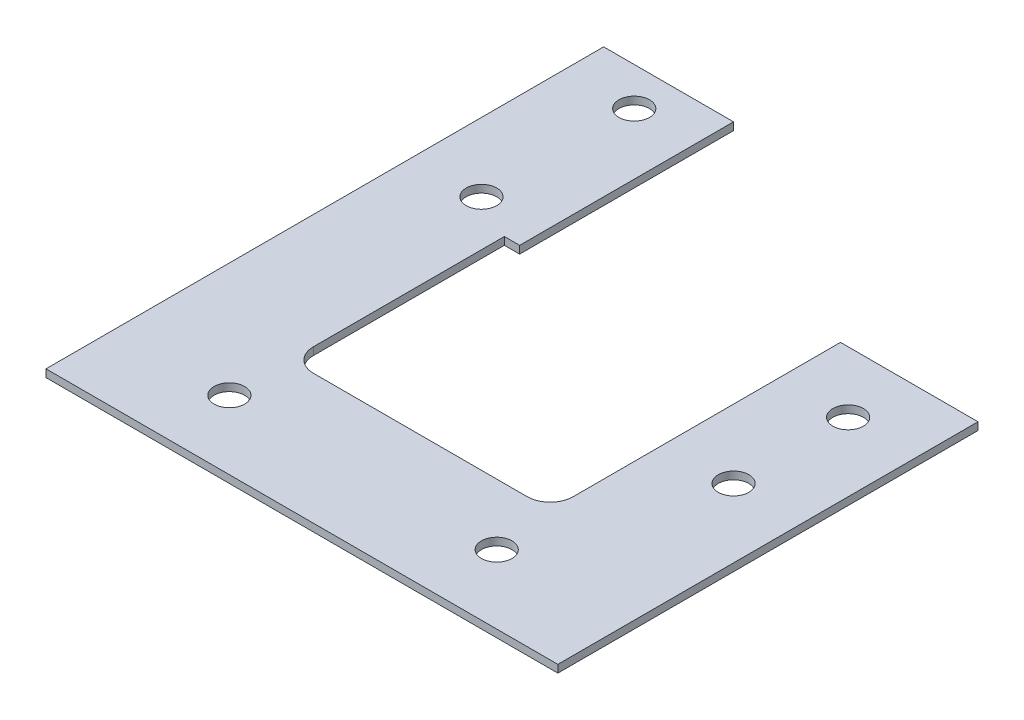
ISO-10303-21;
HEADER;
FILE_DESCRIPTION(('STEP AP214'),'2;1');
FILE_NAME('part.step','',(''),(''),'','','');
FILE_SCHEMA(('AUTOMOTIVE_DESIGN { 1 0 10303 214 1 1 1 1 }'));
ENDSEC;
DATA;
#1=APPLICATION_CONTEXT('core data for automotive mechanical design processes');
#2=APPLICATION_PROTOCOL_DEFINITION('international standard','automotive_design',2000,#1);
#3=PRODUCT_CONTEXT('',#1,'mechanical');
#4=PRODUCT('Part','Part','',(#3));
#5=PRODUCT_RELATED_PRODUCT_CATEGORY('part','',(#4));
#6=PRODUCT_DEFINITION_FORMATION('','',#4);
#7=PRODUCT_DEFINITION_CONTEXT('part definition',#1,'design');
#8=PRODUCT_DEFINITION('design','',#6,#7);
#9=PRODUCT_DEFINITION_SHAPE('','',#8);
#10=(LENGTH_UNIT() NAMED_UNIT(*) SI_UNIT(.MILLI.,.METRE.));
#11=(NAMED_UNIT(*) PLANE_ANGLE_UNIT() SI_UNIT($,.RADIAN.));
#12=(NAMED_UNIT(*) SI_UNIT($,.STERADIAN.) SOLID_ANGLE_UNIT());
#13=UNCERTAINTY_MEASURE_WITH_UNIT(LENGTH_MEASURE(1.E-05),#10,'distance_accuracy_value','');
#14=(GEOMETRIC_REPRESENTATION_CONTEXT(3) GLOBAL_UNCERTAINTY_ASSIGNED_CONTEXT((#13)) GLOBAL_UNIT_ASSIGNED_CONTEXT((#10,
#11,#12)) REPRESENTATION_CONTEXT('',''));
#15=CARTESIAN_POINT('',(0.,0.,0.));
#16=DIRECTION('',(0.,0.,1.));
#17=DIRECTION('',(1.,0.,0.));
#18=AXIS2_PLACEMENT_3D('',#15,#16,#17);
#19=CARTESIAN_POINT('',(-6.,1.,-5.));
#20=DIRECTION('',(0.,-1.,0.));
#21=DIRECTION('',(0.,0.,-1.));
#22=AXIS2_PLACEMENT_3D('',#19,#20,#21);
#23=PLANE('',#22);
#24=DIRECTION('',(0.,0.,-1.));
#25=VECTOR('',#24,1.);
#26=CARTESIAN_POINT('',(15.,1.,0.));
#27=LINE('',#26,#25);
#28=CARTESIAN_POINT('',(15.,1.,15.));
#29=VERTEX_POINT('',#28);
#30=CARTESIAN_POINT('',(15.,1.,-40.));
#31=VERTEX_POINT('',#30);
#32=EDGE_CURVE('E50',#29,#31,#27,.T.);
#33=ORIENTED_EDGE('',*,*,#32,.T.);
#34=DIRECTION('',(-1.,0.,0.));
#35=VECTOR('',#34,1.);
#36=CARTESIAN_POINT('',(0.,1.,-40.));
#37=LINE('',#36,#35);
#38=CARTESIAN_POINT('',(-3.,1.,-40.));
#39=VERTEX_POINT('',#38);
#40=EDGE_CURVE('E106',#31,#39,#37,.T.);
#41=ORIENTED_EDGE('',*,*,#40,.T.);
#42=DIRECTION('',(0.,0.,1.));
#43=VECTOR('',#42,1.);
#44=CARTESIAN_POINT('',(-3.,1.,-40.));
#45=LINE('',#44,#43);
#46=CARTESIAN_POINT('',(-3.,1.,-5.00000000000002));
#47=VERTEX_POINT('',#46);
#48=EDGE_CURVE('E207',#39,#47,#45,.T.);
#49=ORIENTED_EDGE('',*,*,#48,.T.);
#50=CARTESIAN_POINT('',(-6.,1.,-5.));
#51=DIRECTION('',(0.,-1.,0.));
#52=DIRECTION('',(0.,0.,-1.));
#53=AXIS2_PLACEMENT_3D('',#50,#51,#52);
#54=CIRCLE('',#53,3.);
#55=CARTESIAN_POINT('',(-6.00000000000002,1.,-2.));
#56=VERTEX_POINT('',#55);
#57=EDGE_CURVE('E226',#47,#56,#54,.T.);
#58=ORIENTED_EDGE('',*,*,#57,.T.);
#59=DIRECTION('',(-1.,0.,0.));
#60=VECTOR('',#59,1.);
#61=CARTESIAN_POINT('',(-6.00000000000002,1.,-2.));
#62=LINE('',#61,#60);
#63=CARTESIAN_POINT('',(-34.,1.,-2.));
#64=VERTEX_POINT('',#63);
#65=EDGE_CURVE('E223',#56,#64,#62,.T.);
#66=ORIENTED_EDGE('',*,*,#65,.T.);
#67=CARTESIAN_POINT('',(-34.,1.,-5.));
#68=DIRECTION('',(0.,-1.,0.));
#69=DIRECTION('',(0.,0.,-1.));
#70=AXIS2_PLACEMENT_3D('',#67,#68,#69);
#71=CIRCLE('',#70,3.);
#72=CARTESIAN_POINT('',(-37.,1.,-5.00000000000002));
#73=VERTEX_POINT('',#72);
#74=EDGE_CURVE('E225',#64,#73,#71,.T.);
#75=ORIENTED_EDGE('',*,*,#74,.T.);
#76=DIRECTION('',(0.,0.,-1.));
#77=VECTOR('',#76,1.);
#78=CARTESIAN_POINT('',(-37.,1.,-30.));
#79=LINE('',#78,#77);
#80=CARTESIAN_POINT('',(-37.,1.,-30.));
#81=VERTEX_POINT('',#80);
#82=EDGE_CURVE('E228',#73,#81,#79,.T.);
#83=ORIENTED_EDGE('',*,*,#82,.T.);
#84=DIRECTION('',(1.,0.,0.));
#85=VECTOR('',#84,1.);
#86=CARTESIAN_POINT('',(-35.,1.,-30.));
#87=LINE('',#86,#85);
#88=CARTESIAN_POINT('',(-35.,1.,-30.));
#89=VERTEX_POINT('',#88);
#90=EDGE_CURVE('E234',#81,#89,#87,.T.);
#91=ORIENTED_EDGE('',*,*,#90,.T.);
#92=DIRECTION('',(0.,0.,-1.));
#93=VECTOR('',#92,1.);
#94=CARTESIAN_POINT('',(-35.,1.,-58.));
#95=LINE('',#94,#93);
#96=CARTESIAN_POINT('',(-35.,1.,-58.));
#97=VERTEX_POINT('',#96);
#98=EDGE_CURVE('E138',#89,#97,#95,.T.);
#99=ORIENTED_EDGE('',*,*,#98,.T.);
#100=DIRECTION('',(-1.,0.,0.));
#101=VECTOR('',#100,1.);
#102=CARTESIAN_POINT('',(-37.,1.,-58.));
#103=LINE('',#102,#101);
#104=CARTESIAN_POINT('',(-52.,1.,-58.));
#105=VERTEX_POINT('',#104);
#106=EDGE_CURVE('E132',#97,#105,#103,.T.);
#107=ORIENTED_EDGE('',*,*,#106,.T.);
#108=DIRECTION('',(0.,0.,1.));
#109=VECTOR('',#108,1.);
#110=CARTESIAN_POINT('',(-52.,1.,15.));
#111=LINE('',#110,#109);
#112=CARTESIAN_POINT('',(-52.,1.,15.));
#113=VERTEX_POINT('',#112);
#114=EDGE_CURVE('E136',#105,#113,#111,.T.);
#115=ORIENTED_EDGE('',*,*,#114,.T.);
#116=DIRECTION('',(1.,0.,0.));
#117=VECTOR('',#116,1.);
#118=CARTESIAN_POINT('',(15.,1.,15.));
#119=LINE('',#118,#117);
#120=EDGE_CURVE('E151',#113,#29,#119,.T.);
#121=ORIENTED_EDGE('',*,*,#120,.T.);
#122=EDGE_LOOP('',(#33,#41,#49,#58,#66,#75,#83,#91,#99,#107,#115,#121));
#123=FACE_BOUND('',#122,.T.);
#124=CARTESIAN_POINT('',(6.,1.,-32.));
#125=DIRECTION('',(0.,1.,0.));
#126=DIRECTION('',(0.,0.,1.));
#127=AXIS2_PLACEMENT_3D('',#124,#125,#126);
#128=CIRCLE('',#127,2.);
#129=CARTESIAN_POINT('',(6.,1.,-30.));
#130=VERTEX_POINT('',#129);
#131=EDGE_CURVE('E160',#130,#130,#128,.T.);
#132=ORIENTED_EDGE('',*,*,#131,.F.);
#133=EDGE_LOOP('',(#132));
#134=FACE_BOUND('',#133,.T.);
#135=CARTESIAN_POINT('',(6.,1.,-17.));
#136=DIRECTION('',(0.,1.,0.));
#137=DIRECTION('',(0.,0.,1.));
#138=AXIS2_PLACEMENT_3D('',#135,#136,#137);
#139=CIRCLE('',#138,2.);
#140=CARTESIAN_POINT('',(6.,1.,-15.));
#141=VERTEX_POINT('',#140);
#142=EDGE_CURVE('E462',#141,#141,#139,.T.);
#143=ORIENTED_EDGE('',*,*,#142,.F.);
#144=EDGE_LOOP('',(#143));
#145=FACE_BOUND('',#144,.T.);
#146=CARTESIAN_POINT('',(-43.,1.,-53.));
#147=DIRECTION('',(0.,1.,0.));
#148=DIRECTION('',(0.,0.,1.));
#149=AXIS2_PLACEMENT_3D('',#146,#147,#148);
#150=CIRCLE('',#149,2.);
#151=CARTESIAN_POINT('',(-43.,1.,-51.));
#152=VERTEX_POINT('',#151);
#153=EDGE_CURVE('E456',#152,#152,#150,.T.);
#154=ORIENTED_EDGE('',*,*,#153,.F.);
#155=EDGE_LOOP('',(#154));
#156=FACE_BOUND('',#155,.T.);
#157=CARTESIAN_POINT('',(-43.,1.,-33.));
#158=DIRECTION('',(0.,1.,0.));
#159=DIRECTION('',(0.,0.,1.));
#160=AXIS2_PLACEMENT_3D('',#157,#158,#159);
#161=CIRCLE('',#160,2.);
#162=CARTESIAN_POINT('',(-43.,1.,-31.));
#163=VERTEX_POINT('',#162);
#164=EDGE_CURVE('E450',#163,#163,#161,.T.);
#165=ORIENTED_EDGE('',*,*,#164,.F.);
#166=EDGE_LOOP('',(#165));
#167=FACE_BOUND('',#166,.T.);
#168=CARTESIAN_POINT('',(-37.,1.,6.));
#169=DIRECTION('',(0.,1.,0.));
#170=DIRECTION('',(0.,0.,1.));
#171=AXIS2_PLACEMENT_3D('',#168,#169,#170);
#172=CIRCLE('',#171,2.);
#173=CARTESIAN_POINT('',(-37.,1.,8.00000000000001));
#174=VERTEX_POINT('',#173);
#175=EDGE_CURVE('E444',#174,#174,#172,.T.);
#176=ORIENTED_EDGE('',*,*,#175,.F.);
#177=EDGE_LOOP('',(#176));
#178=FACE_BOUND('',#177,.T.);
#179=CARTESIAN_POINT('',(-1.99999999999999,1.,5.99999999999997));
#180=DIRECTION('',(0.,1.,0.));
#181=DIRECTION('',(0.,0.,1.));
#182=AXIS2_PLACEMENT_3D('',#179,#180,#181);
#183=CIRCLE('',#182,2.);
#184=CARTESIAN_POINT('',(-1.99999999999999,1.,7.99999999999997));
#185=VERTEX_POINT('',#184);
#186=EDGE_CURVE('E435',#185,#185,#183,.T.);
#187=ORIENTED_EDGE('',*,*,#186,.F.);
#188=EDGE_LOOP('',(#187));
#189=FACE_BOUND('',#188,.T.);
#190=ADVANCED_FACE('F33',(#123,#134,#145,#156,#167,#178,#189),#23,.F.);
#191=CARTESIAN_POINT('',(-6.,0.,-5.));
#192=DIRECTION('',(0.,-1.,0.));
#193=DIRECTION('',(0.,0.,-1.));
#194=AXIS2_PLACEMENT_3D('',#191,#192,#193);
#195=PLANE('',#194);
#196=CARTESIAN_POINT('',(-37.,0.,6.));
#197=DIRECTION('',(0.,1.,0.));
#198=DIRECTION('',(0.,0.,1.));
#199=AXIS2_PLACEMENT_3D('',#196,#197,#198);
#200=CIRCLE('',#199,2.);
#201=CARTESIAN_POINT('',(-37.,0.,8.00000000000001));
#202=VERTEX_POINT('',#201);
#203=EDGE_CURVE('E441',#202,#202,#200,.T.);
#204=ORIENTED_EDGE('',*,*,#203,.T.);
#205=EDGE_LOOP('',(#204));
#206=FACE_BOUND('',#205,.T.);
#207=CARTESIAN_POINT('',(-43.,0.,-53.));
#208=DIRECTION('',(0.,1.,0.));
#209=DIRECTION('',(0.,0.,1.));
#210=AXIS2_PLACEMENT_3D('',#207,#208,#209);
#211=CIRCLE('',#210,2.);
#212=CARTESIAN_POINT('',(-43.,0.,-51.));
#213=VERTEX_POINT('',#212);
#214=EDGE_CURVE('E453',#213,#213,#211,.T.);
#215=ORIENTED_EDGE('',*,*,#214,.T.);
#216=EDGE_LOOP('',(#215));
#217=FACE_BOUND('',#216,.T.);
#218=CARTESIAN_POINT('',(6.,0.,-32.));
#219=DIRECTION('',(0.,1.,0.));
#220=DIRECTION('',(0.,0.,1.));
#221=AXIS2_PLACEMENT_3D('',#218,#219,#220);
#222=CIRCLE('',#221,2.);
#223=CARTESIAN_POINT('',(6.,0.,-30.));
#224=VERTEX_POINT('',#223);
#225=EDGE_CURVE('E465',#224,#224,#222,.T.);
#226=ORIENTED_EDGE('',*,*,#225,.T.);
#227=EDGE_LOOP('',(#226));
#228=FACE_BOUND('',#227,.T.);
#229=DIRECTION('',(-1.,0.,0.));
#230=VECTOR('',#229,1.);
#231=CARTESIAN_POINT('',(0.,0.,-40.));
#232=LINE('',#231,#230);
#233=CARTESIAN_POINT('',(15.,0.,-40.));
#234=VERTEX_POINT('',#233);
#235=CARTESIAN_POINT('',(-3.,0.,-40.));
#236=VERTEX_POINT('',#235);
#237=EDGE_CURVE('E157',#234,#236,#232,.T.);
#238=ORIENTED_EDGE('',*,*,#237,.F.);
#239=DIRECTION('',(0.,0.,-1.));
#240=VECTOR('',#239,1.);
#241=CARTESIAN_POINT('',(15.,0.,0.));
#242=LINE('',#241,#240);
#243=CARTESIAN_POINT('',(15.,0.,15.));
#244=VERTEX_POINT('',#243);
#245=EDGE_CURVE('E178',#244,#234,#242,.T.);
#246=ORIENTED_EDGE('',*,*,#245,.F.);
#247=DIRECTION('',(1.,0.,0.));
#248=VECTOR('',#247,1.);
#249=CARTESIAN_POINT('',(15.,0.,15.));
#250=LINE('',#249,#248);
#251=CARTESIAN_POINT('',(-52.,0.,15.));
#252=VERTEX_POINT('',#251);
#253=EDGE_CURVE('E99',#252,#244,#250,.T.);
#254=ORIENTED_EDGE('',*,*,#253,.F.);
#255=DIRECTION('',(0.,0.,1.));
#256=VECTOR('',#255,1.);
#257=CARTESIAN_POINT('',(-52.,0.,15.));
#258=LINE('',#257,#256);
#259=CARTESIAN_POINT('',(-52.,0.,-58.));
#260=VERTEX_POINT('',#259);
#261=EDGE_CURVE('E92',#260,#252,#258,.T.);
#262=ORIENTED_EDGE('',*,*,#261,.F.);
#263=DIRECTION('',(-1.,0.,0.));
#264=VECTOR('',#263,1.);
#265=CARTESIAN_POINT('',(-52.,0.,-58.));
#266=LINE('',#265,#264);
#267=CARTESIAN_POINT('',(-35.,0.,-58.));
#268=VERTEX_POINT('',#267);
#269=EDGE_CURVE('E145',#268,#260,#266,.T.);
#270=ORIENTED_EDGE('',*,*,#269,.F.);
#271=DIRECTION('',(0.,0.,-1.));
#272=VECTOR('',#271,1.);
#273=CARTESIAN_POINT('',(-35.,0.,-58.));
#274=LINE('',#273,#272);
#275=CARTESIAN_POINT('',(-35.,0.,-30.));
#276=VERTEX_POINT('',#275);
#277=EDGE_CURVE('E172',#276,#268,#274,.T.);
#278=ORIENTED_EDGE('',*,*,#277,.F.);
#279=DIRECTION('',(1.,0.,0.));
#280=VECTOR('',#279,1.);
#281=CARTESIAN_POINT('',(-35.,0.,-30.));
#282=LINE('',#281,#280);
#283=CARTESIAN_POINT('',(-37.,0.,-30.));
#284=VERTEX_POINT('',#283);
#285=EDGE_CURVE('E170',#284,#276,#282,.T.);
#286=ORIENTED_EDGE('',*,*,#285,.F.);
#287=DIRECTION('',(0.,0.,-1.));
#288=VECTOR('',#287,1.);
#289=CARTESIAN_POINT('',(-37.,0.,-30.));
#290=LINE('',#289,#288);
#291=CARTESIAN_POINT('',(-37.,0.,-5.00000000000002));
#292=VERTEX_POINT('',#291);
#293=EDGE_CURVE('E168',#292,#284,#290,.T.);
#294=ORIENTED_EDGE('',*,*,#293,.F.);
#295=CARTESIAN_POINT('',(-34.,0.,-5.));
#296=DIRECTION('',(0.,-1.,0.));
#297=DIRECTION('',(0.,0.,-1.));
#298=AXIS2_PLACEMENT_3D('',#295,#296,#297);
#299=CIRCLE('',#298,3.);
#300=CARTESIAN_POINT('',(-34.,0.,-2.));
#301=VERTEX_POINT('',#300);
#302=EDGE_CURVE('E166',#301,#292,#299,.T.);
#303=ORIENTED_EDGE('',*,*,#302,.F.);
#304=DIRECTION('',(-1.,0.,0.));
#305=VECTOR('',#304,1.);
#306=CARTESIAN_POINT('',(-6.00000000000002,0.,-2.));
#307=LINE('',#306,#305);
#308=CARTESIAN_POINT('',(-6.00000000000002,0.,-2.));
#309=VERTEX_POINT('',#308);
#310=EDGE_CURVE('E164',#309,#301,#307,.T.);
#311=ORIENTED_EDGE('',*,*,#310,.F.);
#312=CARTESIAN_POINT('',(-6.,0.,-5.));
#313=DIRECTION('',(0.,-1.,0.));
#314=DIRECTION('',(0.,0.,-1.));
#315=AXIS2_PLACEMENT_3D('',#312,#313,#314);
#316=CIRCLE('',#315,3.);
#317=CARTESIAN_POINT('',(-3.,0.,-5.00000000000002));
#318=VERTEX_POINT('',#317);
#319=EDGE_CURVE('E162',#318,#309,#316,.T.);
#320=ORIENTED_EDGE('',*,*,#319,.F.);
#321=DIRECTION('',(0.,0.,1.));
#322=VECTOR('',#321,1.);
#323=CARTESIAN_POINT('',(-3.,0.,-40.));
#324=LINE('',#323,#322);
#325=EDGE_CURVE('E159',#236,#318,#324,.T.);
#326=ORIENTED_EDGE('',*,*,#325,.F.);
#327=EDGE_LOOP('',(#238,#246,#254,#262,#270,#278,#286,#294,#303,#311,#320,#326));
#328=FACE_BOUND('',#327,.T.);
#329=CARTESIAN_POINT('',(6.,0.,-17.));
#330=DIRECTION('',(0.,1.,0.));
#331=DIRECTION('',(0.,0.,1.));
#332=AXIS2_PLACEMENT_3D('',#329,#330,#331);
#333=CIRCLE('',#332,2.);
#334=CARTESIAN_POINT('',(6.,0.,-15.));
#335=VERTEX_POINT('',#334);
#336=EDGE_CURVE('E459',#335,#335,#333,.T.);
#337=ORIENTED_EDGE('',*,*,#336,.T.);
#338=EDGE_LOOP('',(#337));
#339=FACE_BOUND('',#338,.T.);
#340=CARTESIAN_POINT('',(-43.,0.,-33.));
#341=DIRECTION('',(0.,1.,0.));
#342=DIRECTION('',(0.,0.,1.));
#343=AXIS2_PLACEMENT_3D('',#340,#341,#342);
#344=CIRCLE('',#343,2.);
#345=CARTESIAN_POINT('',(-43.,0.,-31.));
#346=VERTEX_POINT('',#345);
#347=EDGE_CURVE('E447',#346,#346,#344,.T.);
#348=ORIENTED_EDGE('',*,*,#347,.T.);
#349=EDGE_LOOP('',(#348));
#350=FACE_BOUND('',#349,.T.);
#351=CARTESIAN_POINT('',(-1.99999999999999,0.,5.99999999999997));
#352=DIRECTION('',(0.,1.,0.));
#353=DIRECTION('',(0.,0.,1.));
#354=AXIS2_PLACEMENT_3D('',#351,#352,#353);
#355=CIRCLE('',#354,2.);
#356=CARTESIAN_POINT('',(-1.99999999999999,0.,7.99999999999997));
#357=VERTEX_POINT('',#356);
#358=EDGE_CURVE('E438',#357,#357,#355,.T.);
#359=ORIENTED_EDGE('',*,*,#358,.T.);
#360=EDGE_LOOP('',(#359));
#361=FACE_BOUND('',#360,.T.);
#362=ADVANCED_FACE('F210',(#206,#217,#228,#328,#339,#350,#361),#195,.T.);
#363=CARTESIAN_POINT('',(0.,1.,-40.));
#364=DIRECTION('',(0.,0.,1.));
#365=DIRECTION('',(1.,0.,0.));
#366=AXIS2_PLACEMENT_3D('',#363,#364,#365);
#367=PLANE('',#366);
#368=ORIENTED_EDGE('',*,*,#237,.T.);
#369=DIRECTION('',(0.,-1.,0.));
#370=VECTOR('',#369,1.);
#371=CARTESIAN_POINT('',(-3.,1.,-40.));
#372=LINE('',#371,#370);
#373=EDGE_CURVE('E42',#39,#236,#372,.T.);
#374=ORIENTED_EDGE('',*,*,#373,.F.);
#375=ORIENTED_EDGE('',*,*,#40,.F.);
#376=DIRECTION('',(0.,-1.,0.));
#377=VECTOR('',#376,1.);
#378=CARTESIAN_POINT('',(15.,1.,-40.));
#379=LINE('',#378,#377);
#380=EDGE_CURVE('E11',#31,#234,#379,.T.);
#381=ORIENTED_EDGE('',*,*,#380,.T.);
#382=EDGE_LOOP('',(#368,#374,#375,#381));
#383=FACE_BOUND('',#382,.T.);
#384=ADVANCED_FACE('F35',(#383),#367,.F.);
#385=CARTESIAN_POINT('',(-3.,1.,-40.));
#386=DIRECTION('',(1.,0.,0.));
#387=DIRECTION('',(0.,0.,-1.));
#388=AXIS2_PLACEMENT_3D('',#385,#386,#387);
#389=PLANE('',#388);
#390=ORIENTED_EDGE('',*,*,#325,.T.);
#391=DIRECTION('',(0.,-1.,0.));
#392=VECTOR('',#391,1.);
#393=CARTESIAN_POINT('',(-3.,1.,-5.00000000000002));
#394=LINE('',#393,#392);
#395=EDGE_CURVE('E199',#47,#318,#394,.T.);
#396=ORIENTED_EDGE('',*,*,#395,.F.);
#397=ORIENTED_EDGE('',*,*,#48,.F.);
#398=ORIENTED_EDGE('',*,*,#373,.T.);
#399=EDGE_LOOP('',(#390,#396,#397,#398));
#400=FACE_BOUND('',#399,.T.);
#401=ADVANCED_FACE('F205',(#400),#389,.F.);
#402=CARTESIAN_POINT('',(-6.,1.,-5.));
#403=DIRECTION('',(0.,-1.,0.));
#404=DIRECTION('',(0.,0.,-1.));
#405=AXIS2_PLACEMENT_3D('',#402,#403,#404);
#406=CYLINDRICAL_SURFACE('',#405,3.);
#407=ORIENTED_EDGE('',*,*,#319,.T.);
#408=DIRECTION('',(0.,-1.,0.));
#409=VECTOR('',#408,1.);
#410=CARTESIAN_POINT('',(-6.00000000000002,1.,-2.));
#411=LINE('',#410,#409);
#412=EDGE_CURVE('E196',#56,#309,#411,.T.);
#413=ORIENTED_EDGE('',*,*,#412,.F.);
#414=ORIENTED_EDGE('',*,*,#57,.F.);
#415=ORIENTED_EDGE('',*,*,#395,.T.);
#416=EDGE_LOOP('',(#407,#413,#414,#415));
#417=FACE_BOUND('',#416,.T.);
#418=ADVANCED_FACE('F217',(#417),#406,.F.);
#419=CARTESIAN_POINT('',(-6.00000000000002,1.,-2.));
#420=DIRECTION('',(0.,0.,1.));
#421=DIRECTION('',(1.,0.,0.));
#422=AXIS2_PLACEMENT_3D('',#419,#420,#421);
#423=PLANE('',#422);
#424=ORIENTED_EDGE('',*,*,#310,.T.);
#425=DIRECTION('',(0.,-1.,0.));
#426=VECTOR('',#425,1.);
#427=CARTESIAN_POINT('',(-34.,1.,-2.));
#428=LINE('',#427,#426);
#429=EDGE_CURVE('E193',#64,#301,#428,.T.);
#430=ORIENTED_EDGE('',*,*,#429,.F.);
#431=ORIENTED_EDGE('',*,*,#65,.F.);
#432=ORIENTED_EDGE('',*,*,#412,.T.);
#433=EDGE_LOOP('',(#424,#430,#431,#432));
#434=FACE_BOUND('',#433,.T.);
#435=ADVANCED_FACE('F221',(#434),#423,.F.);
#436=CARTESIAN_POINT('',(-34.,1.,-5.));
#437=DIRECTION('',(0.,-1.,0.));
#438=DIRECTION('',(0.,0.,-1.));
#439=AXIS2_PLACEMENT_3D('',#436,#437,#438);
#440=CYLINDRICAL_SURFACE('',#439,3.);
#441=ORIENTED_EDGE('',*,*,#302,.T.);
#442=DIRECTION('',(0.,-1.,0.));
#443=VECTOR('',#442,1.);
#444=CARTESIAN_POINT('',(-37.,1.,-5.00000000000002));
#445=LINE('',#444,#443);
#446=EDGE_CURVE('E190',#73,#292,#445,.T.);
#447=ORIENTED_EDGE('',*,*,#446,.F.);
#448=ORIENTED_EDGE('',*,*,#74,.F.);
#449=ORIENTED_EDGE('',*,*,#429,.T.);
#450=EDGE_LOOP('',(#441,#447,#448,#449));
#451=FACE_BOUND('',#450,.T.);
#452=ADVANCED_FACE('F278',(#451),#440,.F.);
#453=CARTESIAN_POINT('',(-37.,1.,-30.));
#454=DIRECTION('',(-1.,0.,0.));
#455=DIRECTION('',(0.,0.,1.));
#456=AXIS2_PLACEMENT_3D('',#453,#454,#455);
#457=PLANE('',#456);
#458=ORIENTED_EDGE('',*,*,#293,.T.);
#459=DIRECTION('',(0.,-1.,0.));
#460=VECTOR('',#459,1.);
#461=CARTESIAN_POINT('',(-37.,1.,-30.));
#462=LINE('',#461,#460);
#463=EDGE_CURVE('E187',#81,#284,#462,.T.);
#464=ORIENTED_EDGE('',*,*,#463,.F.);
#465=ORIENTED_EDGE('',*,*,#82,.F.);
#466=ORIENTED_EDGE('',*,*,#446,.T.);
#467=EDGE_LOOP('',(#458,#464,#465,#466));
#468=FACE_BOUND('',#467,.T.);
#469=ADVANCED_FACE('F275',(#468),#457,.F.);
#470=CARTESIAN_POINT('',(-35.,1.,-30.));
#471=DIRECTION('',(0.,0.,-1.));
#472=DIRECTION('',(-1.,0.,0.));
#473=AXIS2_PLACEMENT_3D('',#470,#471,#472);
#474=PLANE('',#473);
#475=ORIENTED_EDGE('',*,*,#285,.T.);
#476=DIRECTION('',(0.,-1.,0.));
#477=VECTOR('',#476,1.);
#478=CARTESIAN_POINT('',(-35.,1.,-30.));
#479=LINE('',#478,#477);
#480=EDGE_CURVE('E184',#89,#276,#479,.T.);
#481=ORIENTED_EDGE('',*,*,#480,.F.);
#482=ORIENTED_EDGE('',*,*,#90,.F.);
#483=ORIENTED_EDGE('',*,*,#463,.T.);
#484=EDGE_LOOP('',(#475,#481,#482,#483));
#485=FACE_BOUND('',#484,.T.);
#486=ADVANCED_FACE('F240',(#485),#474,.F.);
#487=CARTESIAN_POINT('',(-35.,1.,-58.));
#488=DIRECTION('',(-1.,0.,0.));
#489=DIRECTION('',(0.,0.,1.));
#490=AXIS2_PLACEMENT_3D('',#487,#488,#489);
#491=PLANE('',#490);
#492=ORIENTED_EDGE('',*,*,#277,.T.);
#493=DIRECTION('',(0.,-1.,0.));
#494=VECTOR('',#493,1.);
#495=CARTESIAN_POINT('',(-35.,1.,-58.));
#496=LINE('',#495,#494);
#497=EDGE_CURVE('E146',#97,#268,#496,.T.);
#498=ORIENTED_EDGE('',*,*,#497,.F.);
#499=ORIENTED_EDGE('',*,*,#98,.F.);
#500=ORIENTED_EDGE('',*,*,#480,.T.);
#501=EDGE_LOOP('',(#492,#498,#499,#500));
#502=FACE_BOUND('',#501,.T.);
#503=ADVANCED_FACE('F244',(#502),#491,.F.);
#504=CARTESIAN_POINT('',(-52.,1.,-58.));
#505=DIRECTION('',(0.,0.,1.));
#506=DIRECTION('',(1.,0.,0.));
#507=AXIS2_PLACEMENT_3D('',#504,#505,#506);
#508=PLANE('',#507);
#509=ORIENTED_EDGE('',*,*,#269,.T.);
#510=DIRECTION('',(0.,-1.,0.));
#511=VECTOR('',#510,1.);
#512=CARTESIAN_POINT('',(-52.,1.,-58.));
#513=LINE('',#512,#511);
#514=EDGE_CURVE('E143',#105,#260,#513,.T.);
#515=ORIENTED_EDGE('',*,*,#514,.F.);
#516=ORIENTED_EDGE('',*,*,#106,.F.);
#517=ORIENTED_EDGE('',*,*,#497,.T.);
#518=EDGE_LOOP('',(#509,#515,#516,#517));
#519=FACE_BOUND('',#518,.T.);
#520=ADVANCED_FACE('F144',(#519),#508,.F.);
#521=CARTESIAN_POINT('',(-52.,1.,15.));
#522=DIRECTION('',(1.,0.,0.));
#523=DIRECTION('',(0.,0.,-1.));
#524=AXIS2_PLACEMENT_3D('',#521,#522,#523);
#525=PLANE('',#524);
#526=ORIENTED_EDGE('',*,*,#261,.T.);
#527=DIRECTION('',(0.,-1.,0.));
#528=VECTOR('',#527,1.);
#529=CARTESIAN_POINT('',(-52.,1.,15.));
#530=LINE('',#529,#528);
#531=EDGE_CURVE('E147',#113,#252,#530,.T.);
#532=ORIENTED_EDGE('',*,*,#531,.F.);
#533=ORIENTED_EDGE('',*,*,#114,.F.);
#534=ORIENTED_EDGE('',*,*,#514,.T.);
#535=EDGE_LOOP('',(#526,#532,#533,#534));
#536=FACE_BOUND('',#535,.T.);
#537=ADVANCED_FACE('F149',(#536),#525,.F.);
#538=CARTESIAN_POINT('',(15.,1.,15.));
#539=DIRECTION('',(0.,0.,-1.));
#540=DIRECTION('',(-1.,0.,0.));
#541=AXIS2_PLACEMENT_3D('',#538,#539,#540);
#542=PLANE('',#541);
#543=ORIENTED_EDGE('',*,*,#253,.T.);
#544=DIRECTION('',(0.,-1.,0.));
#545=VECTOR('',#544,1.);
#546=CARTESIAN_POINT('',(15.,1.,15.));
#547=LINE('',#546,#545);
#548=EDGE_CURVE('E153',#29,#244,#547,.T.);
#549=ORIENTED_EDGE('',*,*,#548,.F.);
#550=ORIENTED_EDGE('',*,*,#120,.F.);
#551=ORIENTED_EDGE('',*,*,#531,.T.);
#552=EDGE_LOOP('',(#543,#549,#550,#551));
#553=FACE_BOUND('',#552,.T.);
#554=ADVANCED_FACE('F264',(#553),#542,.F.);
#555=CARTESIAN_POINT('',(15.,1.,0.));
#556=DIRECTION('',(-1.,0.,0.));
#557=DIRECTION('',(0.,0.,1.));
#558=AXIS2_PLACEMENT_3D('',#555,#556,#557);
#559=PLANE('',#558);
#560=ORIENTED_EDGE('',*,*,#245,.T.);
#561=ORIENTED_EDGE('',*,*,#380,.F.);
#562=ORIENTED_EDGE('',*,*,#32,.F.);
#563=ORIENTED_EDGE('',*,*,#548,.T.);
#564=EDGE_LOOP('',(#560,#561,#562,#563));
#565=FACE_BOUND('',#564,.T.);
#566=ADVANCED_FACE('F246',(#565),#559,.F.);
#567=CARTESIAN_POINT('',(6.,1.,-32.));
#568=DIRECTION('',(0.,-1.,0.));
#569=DIRECTION('',(0.,0.,-1.));
#570=AXIS2_PLACEMENT_3D('',#567,#568,#569);
#571=CYLINDRICAL_SURFACE('',#570,2.);
#572=ORIENTED_EDGE('',*,*,#131,.T.);
#573=EDGE_LOOP('',(#572));
#574=FACE_BOUND('',#573,.T.);
#575=ORIENTED_EDGE('',*,*,#225,.F.);
#576=EDGE_LOOP('',(#575));
#577=FACE_BOUND('',#576,.T.);
#578=ADVANCED_FACE('F259',(#574,#577),#571,.F.);
#579=CARTESIAN_POINT('',(6.,1.,-17.));
#580=DIRECTION('',(0.,-1.,0.));
#581=DIRECTION('',(0.,0.,-1.));
#582=AXIS2_PLACEMENT_3D('',#579,#580,#581);
#583=CYLINDRICAL_SURFACE('',#582,2.);
#584=ORIENTED_EDGE('',*,*,#142,.T.);
#585=EDGE_LOOP('',(#584));
#586=FACE_BOUND('',#585,.T.);
#587=ORIENTED_EDGE('',*,*,#336,.F.);
#588=EDGE_LOOP('',(#587));
#589=FACE_BOUND('',#588,.T.);
#590=ADVANCED_FACE('F332',(#586,#589),#583,.F.);
#591=CARTESIAN_POINT('',(-43.,1.,-53.));
#592=DIRECTION('',(0.,-1.,0.));
#593=DIRECTION('',(0.,0.,-1.));
#594=AXIS2_PLACEMENT_3D('',#591,#592,#593);
#595=CYLINDRICAL_SURFACE('',#594,2.);
#596=ORIENTED_EDGE('',*,*,#153,.T.);
#597=EDGE_LOOP('',(#596));
#598=FACE_BOUND('',#597,.T.);
#599=ORIENTED_EDGE('',*,*,#214,.F.);
#600=EDGE_LOOP('',(#599));
#601=FACE_BOUND('',#600,.T.);
#602=ADVANCED_FACE('F339',(#598,#601),#595,.F.);
#603=CARTESIAN_POINT('',(-43.,1.,-33.));
#604=DIRECTION('',(0.,-1.,0.));
#605=DIRECTION('',(0.,0.,-1.));
#606=AXIS2_PLACEMENT_3D('',#603,#604,#605);
#607=CYLINDRICAL_SURFACE('',#606,2.);
#608=ORIENTED_EDGE('',*,*,#164,.T.);
#609=EDGE_LOOP('',(#608));
#610=FACE_BOUND('',#609,.T.);
#611=ORIENTED_EDGE('',*,*,#347,.F.);
#612=EDGE_LOOP('',(#611));
#613=FACE_BOUND('',#612,.T.);
#614=ADVANCED_FACE('F346',(#610,#613),#607,.F.);
#615=CARTESIAN_POINT('',(-37.,1.,6.));
#616=DIRECTION('',(0.,-1.,0.));
#617=DIRECTION('',(0.,0.,-1.));
#618=AXIS2_PLACEMENT_3D('',#615,#616,#617);
#619=CYLINDRICAL_SURFACE('',#618,2.);
#620=ORIENTED_EDGE('',*,*,#175,.T.);
#621=EDGE_LOOP('',(#620));
#622=FACE_BOUND('',#621,.T.);
#623=ORIENTED_EDGE('',*,*,#203,.F.);
#624=EDGE_LOOP('',(#623));
#625=FACE_BOUND('',#624,.T.);
#626=ADVANCED_FACE('F354',(#622,#625),#619,.F.);
#627=CARTESIAN_POINT('',(-1.99999999999999,1.,5.99999999999997));
#628=DIRECTION('',(0.,-1.,0.));
#629=DIRECTION('',(0.,0.,-1.));
#630=AXIS2_PLACEMENT_3D('',#627,#628,#629);
#631=CYLINDRICAL_SURFACE('',#630,2.);
#632=ORIENTED_EDGE('',*,*,#186,.T.);
#633=EDGE_LOOP('',(#632));
#634=FACE_BOUND('',#633,.T.);
#635=ORIENTED_EDGE('',*,*,#358,.F.);
#636=EDGE_LOOP('',(#635));
#637=FACE_BOUND('',#636,.T.);
#638=ADVANCED_FACE('F362',(#634,#637),#631,.F.);
#639=CLOSED_SHELL('',(#190,#362,#384,#401,#418,#435,#452,#469,#486,#503,#520,#537,#554,#566,
#578,#590,#602,#614,#626,#638));
#640=MANIFOLD_SOLID_BREP('B2',#639);
#641=ADVANCED_BREP_SHAPE_REPRESENTATION('',(#18,#640),#14);
#642=SHAPE_DEFINITION_REPRESENTATION(#9,#641);
ENDSEC;
END-ISO-10303-21;
